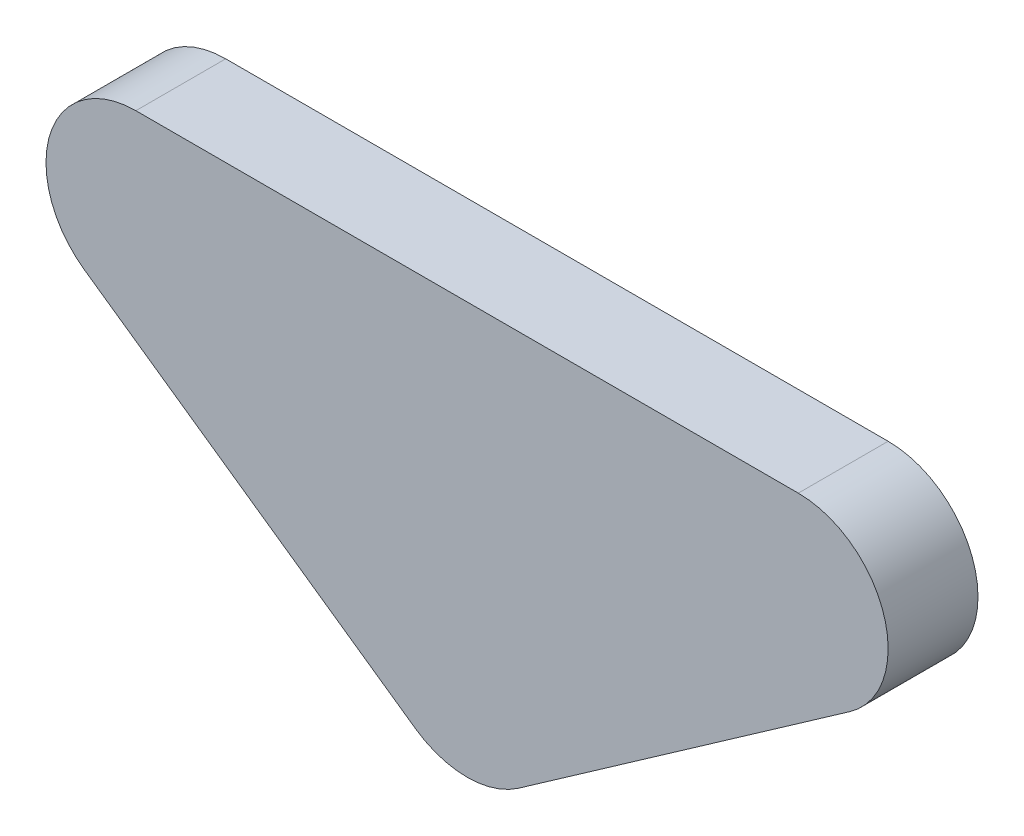
ISO-10303-21;
HEADER;
FILE_DESCRIPTION(('STEP AP214'),'2;1');
FILE_NAME('part.step','',(''),(''),'','','');
FILE_SCHEMA(('AUTOMOTIVE_DESIGN { 1 0 10303 214 1 1 1 1 }'));
ENDSEC;
DATA;
#1=APPLICATION_CONTEXT('core data for automotive mechanical design processes');
#2=APPLICATION_PROTOCOL_DEFINITION('international standard','automotive_design',2000,#1);
#3=PRODUCT_CONTEXT('',#1,'mechanical');
#4=PRODUCT('Part','Part','',(#3));
#5=PRODUCT_RELATED_PRODUCT_CATEGORY('part','',(#4));
#6=PRODUCT_DEFINITION_FORMATION('','',#4);
#7=PRODUCT_DEFINITION_CONTEXT('part definition',#1,'design');
#8=PRODUCT_DEFINITION('design','',#6,#7);
#9=PRODUCT_DEFINITION_SHAPE('','',#8);
#10=(LENGTH_UNIT() NAMED_UNIT(*) SI_UNIT(.MILLI.,.METRE.));
#11=(NAMED_UNIT(*) PLANE_ANGLE_UNIT() SI_UNIT($,.RADIAN.));
#12=(NAMED_UNIT(*) SI_UNIT($,.STERADIAN.) SOLID_ANGLE_UNIT());
#13=UNCERTAINTY_MEASURE_WITH_UNIT(LENGTH_MEASURE(1.E-05),#10,'distance_accuracy_value','');
#14=(GEOMETRIC_REPRESENTATION_CONTEXT(3) GLOBAL_UNCERTAINTY_ASSIGNED_CONTEXT((#13)) GLOBAL_UNIT_ASSIGNED_CONTEXT((#10,
#11,#12)) REPRESENTATION_CONTEXT('',''));
#15=CARTESIAN_POINT('',(0.,0.,0.));
#16=DIRECTION('',(0.,0.,1.));
#17=DIRECTION('',(1.,0.,0.));
#18=AXIS2_PLACEMENT_3D('',#15,#16,#17);
#19=CARTESIAN_POINT('',(-36.8618419930046,25.8109396357971,10.));
#20=DIRECTION('',(0.,0.,-1.));
#21=DIRECTION('',(-1.,0.,0.));
#22=AXIS2_PLACEMENT_3D('',#19,#20,#21);
#23=CYLINDRICAL_SURFACE('',#22,9.99999999999995);
#24=CARTESIAN_POINT('',(-36.8618419930046,25.8109396357971,0.));
#25=DIRECTION('',(0.,0.,1.));
#26=DIRECTION('',(1.,0.,0.));
#27=AXIS2_PLACEMENT_3D('',#24,#25,#26);
#28=CIRCLE('',#27,9.99999999999995);
#29=CARTESIAN_POINT('',(-36.8618419930046,35.8109396357971,0.));
#30=VERTEX_POINT('',#29);
#31=CARTESIAN_POINT('',(-42.5976063565151,17.6194191929072,0.));
#32=VERTEX_POINT('',#31);
#33=EDGE_CURVE('E118',#30,#32,#28,.T.);
#34=ORIENTED_EDGE('',*,*,#33,.T.);
#35=DIRECTION('',(0.,0.,-1.));
#36=VECTOR('',#35,1.);
#37=CARTESIAN_POINT('',(-42.5976063565151,17.6194191929072,10.));
#38=LINE('',#37,#36);
#39=CARTESIAN_POINT('',(-42.5976063565151,17.6194191929072,10.));
#40=VERTEX_POINT('',#39);
#41=EDGE_CURVE('E11',#40,#32,#38,.T.);
#42=ORIENTED_EDGE('',*,*,#41,.F.);
#43=CARTESIAN_POINT('',(-36.8618419930046,25.8109396357971,10.));
#44=DIRECTION('',(0.,0.,1.));
#45=DIRECTION('',(1.,0.,0.));
#46=AXIS2_PLACEMENT_3D('',#43,#44,#45);
#47=CIRCLE('',#46,9.99999999999995);
#48=CARTESIAN_POINT('',(-36.8618419930046,35.8109396357971,10.));
#49=VERTEX_POINT('',#48);
#50=EDGE_CURVE('E128',#49,#40,#47,.T.);
#51=ORIENTED_EDGE('',*,*,#50,.F.);
#52=DIRECTION('',(0.,0.,-1.));
#53=VECTOR('',#52,1.);
#54=CARTESIAN_POINT('',(-36.8618419930046,35.8109396357971,10.));
#55=LINE('',#54,#53);
#56=EDGE_CURVE('E114',#49,#30,#55,.T.);
#57=ORIENTED_EDGE('',*,*,#56,.T.);
#58=EDGE_LOOP('',(#34,#42,#51,#57));
#59=FACE_BOUND('',#58,.T.);
#60=ADVANCED_FACE('F34',(#59),#23,.T.);
#61=CARTESIAN_POINT('',(-42.5976063565151,17.6194191929072,10.));
#62=DIRECTION('',(0.573576436351047,0.819152044288991,0.));
#63=DIRECTION('',(-0.819152044288991,0.573576436351047,0.));
#64=AXIS2_PLACEMENT_3D('',#61,#62,#63);
#65=PLANE('',#64);
#66=DIRECTION('',(0.819152044288991,-0.573576436351047,0.));
#67=VECTOR('',#66,1.);
#68=CARTESIAN_POINT('',(-42.5976063565151,17.6194191929072,0.));
#69=LINE('',#68,#67);
#70=CARTESIAN_POINT('',(-5.73576436351049,-8.19152044288994,0.));
#71=VERTEX_POINT('',#70);
#72=EDGE_CURVE('E121',#32,#71,#69,.T.);
#73=ORIENTED_EDGE('',*,*,#72,.T.);
#74=DIRECTION('',(0.,0.,-1.));
#75=VECTOR('',#74,1.);
#76=CARTESIAN_POINT('',(-5.73576436351049,-8.19152044288994,10.));
#77=LINE('',#76,#75);
#78=CARTESIAN_POINT('',(-5.73576436351049,-8.19152044288994,10.));
#79=VERTEX_POINT('',#78);
#80=EDGE_CURVE('E42',#79,#71,#77,.T.);
#81=ORIENTED_EDGE('',*,*,#80,.F.);
#82=DIRECTION('',(0.819152044288991,-0.573576436351047,0.));
#83=VECTOR('',#82,1.);
#84=CARTESIAN_POINT('',(-42.5976063565151,17.6194191929072,10.));
#85=LINE('',#84,#83);
#86=EDGE_CURVE('E87',#40,#79,#85,.T.);
#87=ORIENTED_EDGE('',*,*,#86,.F.);
#88=ORIENTED_EDGE('',*,*,#41,.T.);
#89=EDGE_LOOP('',(#73,#81,#87,#88));
#90=FACE_BOUND('',#89,.T.);
#91=ADVANCED_FACE('F152',(#90),#65,.F.);
#92=CARTESIAN_POINT('',(0.,0.,10.));
#93=DIRECTION('',(0.,0.,-1.));
#94=DIRECTION('',(-1.,0.,0.));
#95=AXIS2_PLACEMENT_3D('',#92,#93,#94);
#96=CYLINDRICAL_SURFACE('',#95,10.);
#97=CARTESIAN_POINT('',(0.,0.,0.));
#98=DIRECTION('',(0.,0.,1.));
#99=DIRECTION('',(1.,0.,0.));
#100=AXIS2_PLACEMENT_3D('',#97,#98,#99);
#101=CIRCLE('',#100,10.);
#102=CARTESIAN_POINT('',(5.73576436351052,-8.19152044288997,0.));
#103=VERTEX_POINT('',#102);
#104=EDGE_CURVE('E123',#71,#103,#101,.T.);
#105=ORIENTED_EDGE('',*,*,#104,.T.);
#106=DIRECTION('',(0.,0.,-1.));
#107=VECTOR('',#106,1.);
#108=CARTESIAN_POINT('',(5.73576436351052,-8.19152044288997,10.));
#109=LINE('',#108,#107);
#110=CARTESIAN_POINT('',(5.73576436351052,-8.19152044288997,10.));
#111=VERTEX_POINT('',#110);
#112=EDGE_CURVE('E109',#111,#103,#109,.T.);
#113=ORIENTED_EDGE('',*,*,#112,.F.);
#114=CARTESIAN_POINT('',(0.,0.,10.));
#115=DIRECTION('',(0.,0.,1.));
#116=DIRECTION('',(1.,0.,0.));
#117=AXIS2_PLACEMENT_3D('',#114,#115,#116);
#118=CIRCLE('',#117,10.);
#119=EDGE_CURVE('E100',#79,#111,#118,.T.);
#120=ORIENTED_EDGE('',*,*,#119,.F.);
#121=ORIENTED_EDGE('',*,*,#80,.T.);
#122=EDGE_LOOP('',(#105,#113,#120,#121));
#123=FACE_BOUND('',#122,.T.);
#124=ADVANCED_FACE('F134',(#123),#96,.T.);
#125=CARTESIAN_POINT('',(5.73576436351052,-8.19152044288997,10.));
#126=DIRECTION('',(-0.573576436351047,0.819152044288991,0.));
#127=DIRECTION('',(-0.819152044288991,-0.573576436351047,0.));
#128=AXIS2_PLACEMENT_3D('',#125,#126,#127);
#129=PLANE('',#128);
#130=DIRECTION('',(0.819152044288991,0.573576436351047,0.));
#131=VECTOR('',#130,1.);
#132=CARTESIAN_POINT('',(5.73576436351052,-8.19152044288997,0.));
#133=LINE('',#132,#131);
#134=CARTESIAN_POINT('',(42.597606356515,17.6194191929071,0.));
#135=VERTEX_POINT('',#134);
#136=EDGE_CURVE('E108',#103,#135,#133,.T.);
#137=ORIENTED_EDGE('',*,*,#136,.T.);
#138=DIRECTION('',(0.,0.,-1.));
#139=VECTOR('',#138,1.);
#140=CARTESIAN_POINT('',(42.597606356515,17.6194191929071,10.));
#141=LINE('',#140,#139);
#142=CARTESIAN_POINT('',(42.597606356515,17.6194191929071,10.));
#143=VERTEX_POINT('',#142);
#144=EDGE_CURVE('E105',#143,#135,#141,.T.);
#145=ORIENTED_EDGE('',*,*,#144,.F.);
#146=DIRECTION('',(0.819152044288991,0.573576436351047,0.));
#147=VECTOR('',#146,1.);
#148=CARTESIAN_POINT('',(5.73576436351052,-8.19152044288997,10.));
#149=LINE('',#148,#147);
#150=EDGE_CURVE('E94',#111,#143,#149,.T.);
#151=ORIENTED_EDGE('',*,*,#150,.F.);
#152=ORIENTED_EDGE('',*,*,#112,.T.);
#153=EDGE_LOOP('',(#137,#145,#151,#152));
#154=FACE_BOUND('',#153,.T.);
#155=ADVANCED_FACE('F106',(#154),#129,.F.);
#156=CARTESIAN_POINT('',(36.8618419930045,25.8109396357971,10.));
#157=DIRECTION('',(0.,0.,-1.));
#158=DIRECTION('',(-1.,0.,0.));
#159=AXIS2_PLACEMENT_3D('',#156,#157,#158);
#160=CYLINDRICAL_SURFACE('',#159,10.);
#161=CARTESIAN_POINT('',(36.8618419930045,25.8109396357971,0.));
#162=DIRECTION('',(0.,0.,1.));
#163=DIRECTION('',(-1.,0.,0.));
#164=AXIS2_PLACEMENT_3D('',#161,#162,#163);
#165=CIRCLE('',#164,10.);
#166=CARTESIAN_POINT('',(36.8618419930045,35.8109396357971,0.));
#167=VERTEX_POINT('',#166);
#168=EDGE_CURVE('E73',#135,#167,#165,.T.);
#169=ORIENTED_EDGE('',*,*,#168,.T.);
#170=DIRECTION('',(0.,0.,-1.));
#171=VECTOR('',#170,1.);
#172=CARTESIAN_POINT('',(36.8618419930045,35.8109396357971,10.));
#173=LINE('',#172,#171);
#174=CARTESIAN_POINT('',(36.8618419930045,35.8109396357971,10.));
#175=VERTEX_POINT('',#174);
#176=EDGE_CURVE('E110',#175,#167,#173,.T.);
#177=ORIENTED_EDGE('',*,*,#176,.F.);
#178=CARTESIAN_POINT('',(36.8618419930045,25.8109396357971,10.));
#179=DIRECTION('',(0.,0.,1.));
#180=DIRECTION('',(-1.,0.,0.));
#181=AXIS2_PLACEMENT_3D('',#178,#179,#180);
#182=CIRCLE('',#181,10.);
#183=EDGE_CURVE('E98',#143,#175,#182,.T.);
#184=ORIENTED_EDGE('',*,*,#183,.F.);
#185=ORIENTED_EDGE('',*,*,#144,.T.);
#186=EDGE_LOOP('',(#169,#177,#184,#185));
#187=FACE_BOUND('',#186,.T.);
#188=ADVANCED_FACE('F112',(#187),#160,.T.);
#189=CARTESIAN_POINT('',(36.8618419930045,35.8109396357971,10.));
#190=DIRECTION('',(0.,-1.,0.));
#191=DIRECTION('',(0.,0.,-1.));
#192=AXIS2_PLACEMENT_3D('',#189,#190,#191);
#193=PLANE('',#192);
#194=DIRECTION('',(-1.,0.,0.));
#195=VECTOR('',#194,1.);
#196=CARTESIAN_POINT('',(36.8618419930045,35.8109396357971,0.));
#197=LINE('',#196,#195);
#198=EDGE_CURVE('E79',#167,#30,#197,.T.);
#199=ORIENTED_EDGE('',*,*,#198,.T.);
#200=ORIENTED_EDGE('',*,*,#56,.F.);
#201=DIRECTION('',(-1.,0.,0.));
#202=VECTOR('',#201,1.);
#203=CARTESIAN_POINT('',(36.8618419930045,35.8109396357971,10.));
#204=LINE('',#203,#202);
#205=EDGE_CURVE('E50',#175,#49,#204,.T.);
#206=ORIENTED_EDGE('',*,*,#205,.F.);
#207=ORIENTED_EDGE('',*,*,#176,.T.);
#208=EDGE_LOOP('',(#199,#200,#206,#207));
#209=FACE_BOUND('',#208,.T.);
#210=ADVANCED_FACE('F141',(#209),#193,.F.);
#211=CARTESIAN_POINT('',(-36.8618419930046,25.8109396357971,10.));
#212=DIRECTION('',(0.,0.,1.));
#213=DIRECTION('',(1.,0.,0.));
#214=AXIS2_PLACEMENT_3D('',#211,#212,#213);
#215=PLANE('',#214);
#216=ORIENTED_EDGE('',*,*,#50,.T.);
#217=ORIENTED_EDGE('',*,*,#86,.T.);
#218=ORIENTED_EDGE('',*,*,#119,.T.);
#219=ORIENTED_EDGE('',*,*,#150,.T.);
#220=ORIENTED_EDGE('',*,*,#183,.T.);
#221=ORIENTED_EDGE('',*,*,#205,.T.);
#222=EDGE_LOOP('',(#216,#217,#218,#219,#220,#221));
#223=FACE_BOUND('',#222,.T.);
#224=ADVANCED_FACE('F96',(#223),#215,.T.);
#225=CARTESIAN_POINT('',(-36.8618419930046,25.8109396357971,0.));
#226=DIRECTION('',(0.,0.,1.));
#227=DIRECTION('',(1.,0.,0.));
#228=AXIS2_PLACEMENT_3D('',#225,#226,#227);
#229=PLANE('',#228);
#230=ORIENTED_EDGE('',*,*,#33,.F.);
#231=ORIENTED_EDGE('',*,*,#198,.F.);
#232=ORIENTED_EDGE('',*,*,#168,.F.);
#233=ORIENTED_EDGE('',*,*,#136,.F.);
#234=ORIENTED_EDGE('',*,*,#104,.F.);
#235=ORIENTED_EDGE('',*,*,#72,.F.);
#236=EDGE_LOOP('',(#230,#231,#232,#233,#234,#235));
#237=FACE_BOUND('',#236,.T.);
#238=ADVANCED_FACE('F137',(#237),#229,.F.);
#239=CLOSED_SHELL('',(#60,#91,#124,#155,#188,#210,#224,#238));
#240=MANIFOLD_SOLID_BREP('B2',#239);
#241=ADVANCED_BREP_SHAPE_REPRESENTATION('',(#18,#240),#14);
#242=SHAPE_DEFINITION_REPRESENTATION(#9,#241);
ENDSEC;
END-ISO-10303-21;
